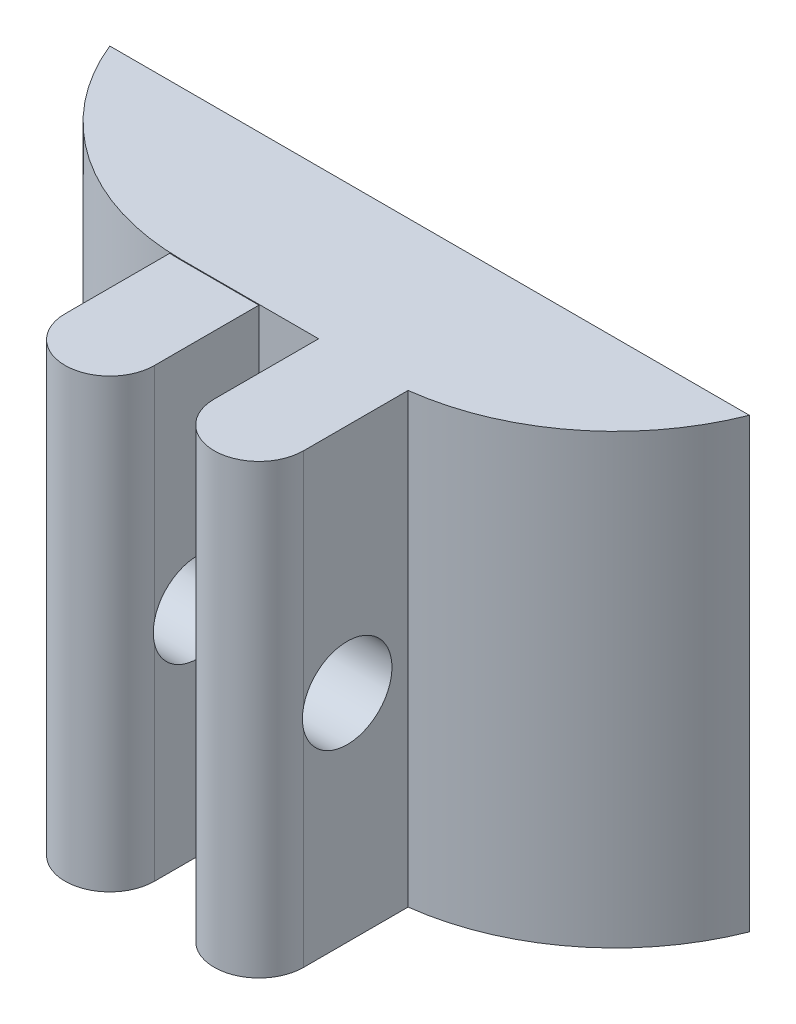
ISO-10303-21;
HEADER;
FILE_DESCRIPTION(('STEP AP214'),'2;1');
FILE_NAME('part.step','',(''),(''),'','','');
FILE_SCHEMA(('AUTOMOTIVE_DESIGN { 1 0 10303 214 1 1 1 1 }'));
ENDSEC;
DATA;
#1=APPLICATION_CONTEXT('core data for automotive mechanical design processes');
#2=APPLICATION_PROTOCOL_DEFINITION('international standard','automotive_design',2000,#1);
#3=PRODUCT_CONTEXT('',#1,'mechanical');
#4=PRODUCT('Part','Part','',(#3));
#5=PRODUCT_RELATED_PRODUCT_CATEGORY('part','',(#4));
#6=PRODUCT_DEFINITION_FORMATION('','',#4);
#7=PRODUCT_DEFINITION_CONTEXT('part definition',#1,'design');
#8=PRODUCT_DEFINITION('design','',#6,#7);
#9=PRODUCT_DEFINITION_SHAPE('','',#8);
#10=(LENGTH_UNIT() NAMED_UNIT(*) SI_UNIT(.MILLI.,.METRE.));
#11=(NAMED_UNIT(*) PLANE_ANGLE_UNIT() SI_UNIT($,.RADIAN.));
#12=(NAMED_UNIT(*) SI_UNIT($,.STERADIAN.) SOLID_ANGLE_UNIT());
#13=UNCERTAINTY_MEASURE_WITH_UNIT(LENGTH_MEASURE(1.E-05),#10,'distance_accuracy_value','');
#14=(GEOMETRIC_REPRESENTATION_CONTEXT(3) GLOBAL_UNCERTAINTY_ASSIGNED_CONTEXT((#13)) GLOBAL_UNIT_ASSIGNED_CONTEXT((#10,
#11,#12)) REPRESENTATION_CONTEXT('',''));
#15=CARTESIAN_POINT('',(0.,0.,0.));
#16=DIRECTION('',(0.,0.,1.));
#17=DIRECTION('',(1.,0.,0.));
#18=AXIS2_PLACEMENT_3D('',#15,#16,#17);
#19=CARTESIAN_POINT('',(-8.49999999999999,-15.,8.5));
#20=DIRECTION('',(0.,-1.,0.));
#21=DIRECTION('',(1.,0.,0.));
#22=AXIS2_PLACEMENT_3D('',#19,#20,#21);
#23=CYLINDRICAL_SURFACE('',#22,1.5);
#24=DIRECTION('',(0.,1.,0.));
#25=VECTOR('',#24,1.);
#26=CARTESIAN_POINT('',(-9.99999999999999,-15.,8.5));
#27=LINE('',#26,#25);
#28=CARTESIAN_POINT('',(-9.99999999999999,-15.,8.5));
#29=VERTEX_POINT('',#28);
#30=CARTESIAN_POINT('',(-10.,-8.11241498930769,8.5));
#31=VERTEX_POINT('',#30);
#32=EDGE_CURVE('E268',#29,#31,#27,.T.);
#33=ORIENTED_EDGE('',*,*,#32,.F.);
#34=CARTESIAN_POINT('',(-8.49999999999999,-15.,8.5));
#35=DIRECTION('',(0.,1.,0.));
#36=DIRECTION('',(-1.,0.,0.));
#37=AXIS2_PLACEMENT_3D('',#34,#35,#36);
#38=CIRCLE('',#37,1.5);
#39=CARTESIAN_POINT('',(-7.,-15.,8.5));
#40=VERTEX_POINT('',#39);
#41=EDGE_CURVE('E48',#40,#29,#38,.F.);
#42=ORIENTED_EDGE('',*,*,#41,.F.);
#43=DIRECTION('',(0.,1.,0.));
#44=VECTOR('',#43,1.);
#45=CARTESIAN_POINT('',(-7.,-15.,8.5));
#46=LINE('',#45,#44);
#47=CARTESIAN_POINT('',(-7.,-8.11241498930769,8.5));
#48=VERTEX_POINT('',#47);
#49=EDGE_CURVE('E275',#48,#40,#46,.F.);
#50=ORIENTED_EDGE('',*,*,#49,.F.);
#51=CARTESIAN_POINT('',(-7.,-7.41254560298488,8.5));
#52=CARTESIAN_POINT('',(-7.00001371546828,-7.45412724418204,8.50998083315785));
#53=CARTESIAN_POINT('',(-7.0001002060891,-7.49613741775952,8.51817415680516));
#54=CARTESIAN_POINT('',(-7.0003019560262,-7.58070019302562,8.53094623275822));
#55=CARTESIAN_POINT('',(-7.00041721297341,-7.6232527497722,8.53552528259058));
#56=CARTESIAN_POINT('',(-7.00055778771822,-7.70741499094998,8.54095494207867));
#57=CARTESIAN_POINT('',(-7.00058549988733,-7.74901828635982,8.54190496227109));
#58=CARTESIAN_POINT('',(-7.00054226277862,-7.83215876470274,8.54034650872186));
#59=CARTESIAN_POINT('',(-7.0004713169154,-7.8736959498741,8.53783815467585));
#60=CARTESIAN_POINT('',(-7.00028181879158,-7.95642005855864,8.52937975231243));
#61=CARTESIAN_POINT('',(-7.00016326453282,-7.99760696729637,8.52342955953406));
#62=CARTESIAN_POINT('',(-7.00000273049525,-8.07934507147401,8.50812900417141));
#63=CARTESIAN_POINT('',(-6.99996075234869,-8.11989625334496,8.49877856911518));
#64=CARTESIAN_POINT('',(-7.00014167531044,-8.20122206947848,8.47642670475488));
#65=CARTESIAN_POINT('',(-7.00037213747244,-8.24197030682407,8.46332907491474));
#66=CARTESIAN_POINT('',(-7.0013953460393,-8.322200778971,8.4337059956231));
#67=CARTESIAN_POINT('',(-7.00218818592812,-8.36168280214909,8.4171799765941));
#68=CARTESIAN_POINT('',(-7.00340465615959,-8.40037620756465,8.39899318441214));
#69=B_SPLINE_CURVE_WITH_KNOTS('',3,(#51,#52,#53,#54,#55,#56,#57,#58,#59,#60,#61,#62,#63,#64,#65,
#66,#67,#68),.UNSPECIFIED.,.F.,.F.,(4,2,2,2,2,2,2,2,4),(0.,0.128248812008016,0.256487065486652,
0.381186174696835,0.505880968132206,0.630580995641018,0.755283681131895,0.883530080847568,
1.01179780394237),.UNSPECIFIED.);
#70=CARTESIAN_POINT('',(-7.,-7.41254560298488,8.5));
#71=VERTEX_POINT('',#70);
#72=EDGE_CURVE('E260',#71,#48,#69,.T.);
#73=ORIENTED_EDGE('',*,*,#72,.F.);
#74=DIRECTION('',(0.,1.,0.));
#75=VECTOR('',#74,1.);
#76=CARTESIAN_POINT('',(-7.,-15.,8.5));
#77=LINE('',#76,#75);
#78=CARTESIAN_POINT('',(-7.,0.,8.5));
#79=VERTEX_POINT('',#78);
#80=EDGE_CURVE('E277',#79,#71,#77,.F.);
#81=ORIENTED_EDGE('',*,*,#80,.F.);
#82=CARTESIAN_POINT('',(-8.5,0.,8.5));
#83=DIRECTION('',(0.,-1.,0.));
#84=DIRECTION('',(1.,0.,0.));
#85=AXIS2_PLACEMENT_3D('',#82,#83,#84);
#86=CIRCLE('',#85,1.5);
#87=CARTESIAN_POINT('',(-10.,0.,8.5));
#88=VERTEX_POINT('',#87);
#89=EDGE_CURVE('E11',#88,#79,#86,.F.);
#90=ORIENTED_EDGE('',*,*,#89,.F.);
#91=DIRECTION('',(0.,1.,0.));
#92=VECTOR('',#91,1.);
#93=CARTESIAN_POINT('',(-9.99999999999999,-15.,8.5));
#94=LINE('',#93,#92);
#95=CARTESIAN_POINT('',(-10.,-7.41254560298488,8.5));
#96=VERTEX_POINT('',#95);
#97=EDGE_CURVE('E283',#96,#88,#94,.T.);
#98=ORIENTED_EDGE('',*,*,#97,.F.);
#99=CARTESIAN_POINT('',(-10.,-8.11241498930769,8.5));
#100=CARTESIAN_POINT('',(-9.99998628453172,-8.07083334811054,8.50998083315785));
#101=CARTESIAN_POINT('',(-9.99989979391089,-8.02882317453306,8.51817415680516));
#102=CARTESIAN_POINT('',(-9.99969804397379,-7.94426039926696,8.53094623275822));
#103=CARTESIAN_POINT('',(-9.99958278702658,-7.90170784252037,8.53552528259058));
#104=CARTESIAN_POINT('',(-9.99944221228177,-7.8175456013426,8.54095494207867));
#105=CARTESIAN_POINT('',(-9.99941450011267,-7.77594230593276,8.54190496227109));
#106=CARTESIAN_POINT('',(-9.99945773722137,-7.69280182758984,8.54034650872186));
#107=CARTESIAN_POINT('',(-9.99952868308459,-7.65126464241848,8.53783815467585));
#108=CARTESIAN_POINT('',(-9.99971818120842,-7.56854053373394,8.52937975231243));
#109=CARTESIAN_POINT('',(-9.99983673546718,-7.52735362499621,8.52342955953406));
#110=CARTESIAN_POINT('',(-9.99999726950474,-7.44561552081858,8.50812900417141));
#111=CARTESIAN_POINT('',(-10.0000392476513,-7.40506433894762,8.49877856911519));
#112=CARTESIAN_POINT('',(-9.99985832468955,-7.3237385228141,8.47642670475488));
#113=CARTESIAN_POINT('',(-9.99962786252755,-7.28299028546851,8.46332907491475));
#114=CARTESIAN_POINT('',(-9.9986046539607,-7.20275981332158,8.4337059956231));
#115=CARTESIAN_POINT('',(-9.99781181407187,-7.16327779014349,8.41717997659411));
#116=CARTESIAN_POINT('',(-9.99659534384041,-7.12458438472793,8.39899318441214));
#117=B_SPLINE_CURVE_WITH_KNOTS('',3,(#99,#100,#101,#102,#103,#104,#105,#106,#107,#108,#109,#110,
#111,#112,#113,#114,#115,#116),.UNSPECIFIED.,.F.,.F.,(4,2,2,2,2,2,2,2,4),(0.,0.128248812008016,
0.25648706548665,0.381186174696835,0.505880968132204,0.630580995641014,0.755283681131891,
0.883530080847564,1.01179780394237),.UNSPECIFIED.);
#118=EDGE_CURVE('E267',#31,#96,#117,.T.);
#119=ORIENTED_EDGE('',*,*,#118,.F.);
#120=EDGE_LOOP('',(#33,#42,#50,#73,#81,#90,#98,#119));
#121=FACE_BOUND('',#120,.T.);
#122=ADVANCED_FACE('F39',(#121),#23,.T.);
#123=CARTESIAN_POINT('',(-13.5,-15.,8.5));
#124=DIRECTION('',(0.,-1.,0.));
#125=DIRECTION('',(1.,0.,0.));
#126=AXIS2_PLACEMENT_3D('',#123,#124,#125);
#127=CYLINDRICAL_SURFACE('',#126,1.5);
#128=DIRECTION('',(0.,1.,0.));
#129=VECTOR('',#128,1.);
#130=CARTESIAN_POINT('',(-15.,-15.,8.5));
#131=LINE('',#130,#129);
#132=CARTESIAN_POINT('',(-15.,-15.,8.5));
#133=VERTEX_POINT('',#132);
#134=CARTESIAN_POINT('',(-15.,-8.11241498930769,8.5));
#135=VERTEX_POINT('',#134);
#136=EDGE_CURVE('E225',#133,#135,#131,.T.);
#137=ORIENTED_EDGE('',*,*,#136,.F.);
#138=CARTESIAN_POINT('',(-13.5,-15.,8.5));
#139=DIRECTION('',(0.,1.,0.));
#140=DIRECTION('',(-1.,0.,0.));
#141=AXIS2_PLACEMENT_3D('',#138,#139,#140);
#142=CIRCLE('',#141,1.5);
#143=CARTESIAN_POINT('',(-12.,-15.,8.5));
#144=VERTEX_POINT('',#143);
#145=EDGE_CURVE('E319',#144,#133,#142,.F.);
#146=ORIENTED_EDGE('',*,*,#145,.F.);
#147=DIRECTION('',(0.,1.,0.));
#148=VECTOR('',#147,1.);
#149=CARTESIAN_POINT('',(-12.,-15.,8.5));
#150=LINE('',#149,#148);
#151=CARTESIAN_POINT('',(-12.,-8.11241498930769,8.5));
#152=VERTEX_POINT('',#151);
#153=EDGE_CURVE('E152',#152,#144,#150,.F.);
#154=ORIENTED_EDGE('',*,*,#153,.F.);
#155=CARTESIAN_POINT('',(-12.,-7.41254560298488,8.5));
#156=CARTESIAN_POINT('',(-12.0000137154683,-7.45412724418204,8.50998083315785));
#157=CARTESIAN_POINT('',(-12.0001002060891,-7.49613741775952,8.51817415680516));
#158=CARTESIAN_POINT('',(-12.0003019560262,-7.58070019302562,8.53094623275822));
#159=CARTESIAN_POINT('',(-12.0004172129734,-7.6232527497722,8.53552528259058));
#160=CARTESIAN_POINT('',(-12.0005577877182,-7.70741499094998,8.54095494207867));
#161=CARTESIAN_POINT('',(-12.0005854998873,-7.74901828635982,8.54190496227109));
#162=CARTESIAN_POINT('',(-12.0005422627786,-7.83215876470274,8.54034650872186));
#163=CARTESIAN_POINT('',(-12.0004713169154,-7.8736959498741,8.53783815467585));
#164=CARTESIAN_POINT('',(-12.0002818187916,-7.95642005855864,8.52937975231243));
#165=CARTESIAN_POINT('',(-12.0001632645328,-7.99760696729637,8.52342955953406));
#166=CARTESIAN_POINT('',(-12.0000027304953,-8.07934507147401,8.50812900417141));
#167=CARTESIAN_POINT('',(-11.9999607523487,-8.11989625334496,8.49877856911518));
#168=CARTESIAN_POINT('',(-12.0001416753104,-8.20122206947848,8.47642670475488));
#169=CARTESIAN_POINT('',(-12.0003721374724,-8.24197030682407,8.46332907491474));
#170=CARTESIAN_POINT('',(-12.0013953460393,-8.322200778971,8.4337059956231));
#171=CARTESIAN_POINT('',(-12.0021881859281,-8.36168280214909,8.4171799765941));
#172=CARTESIAN_POINT('',(-12.0034046561596,-8.40037620756465,8.39899318441214));
#173=B_SPLINE_CURVE_WITH_KNOTS('',3,(#155,#156,#157,#158,#159,#160,#161,#162,#163,#164,#165,
#166,#167,#168,#169,#170,#171,#172),.UNSPECIFIED.,.F.,.F.,(4,2,2,2,2,2,2,2,4),(0.,
0.128248812008016,0.256487065486652,0.381186174696835,0.505880968132206,0.630580995641018,
0.755283681131895,0.883530080847568,1.01179780394237),.UNSPECIFIED.);
#174=CARTESIAN_POINT('',(-12.,-7.41254560298488,8.5));
#175=VERTEX_POINT('',#174);
#176=EDGE_CURVE('E228',#175,#152,#173,.T.);
#177=ORIENTED_EDGE('',*,*,#176,.F.);
#178=DIRECTION('',(0.,1.,0.));
#179=VECTOR('',#178,1.);
#180=CARTESIAN_POINT('',(-12.,-15.,8.5));
#181=LINE('',#180,#179);
#182=CARTESIAN_POINT('',(-12.,-0.0236385703849002,8.5));
#183=VERTEX_POINT('',#182);
#184=EDGE_CURVE('E318',#183,#175,#181,.F.);
#185=ORIENTED_EDGE('',*,*,#184,.F.);
#186=CARTESIAN_POINT('',(-13.5,-0.0236385703849002,8.5));
#187=DIRECTION('',(0.,-1.,0.));
#188=DIRECTION('',(0.,0.,-1.));
#189=AXIS2_PLACEMENT_3D('',#186,#187,#188);
#190=CIRCLE('',#189,1.5);
#191=CARTESIAN_POINT('',(-15.,-0.0236385703849002,8.5));
#192=VERTEX_POINT('',#191);
#193=EDGE_CURVE('E299',#192,#183,#190,.F.);
#194=ORIENTED_EDGE('',*,*,#193,.F.);
#195=DIRECTION('',(0.,1.,0.));
#196=VECTOR('',#195,1.);
#197=CARTESIAN_POINT('',(-15.,-15.,8.5));
#198=LINE('',#197,#196);
#199=CARTESIAN_POINT('',(-15.,-7.41254560298488,8.5));
#200=VERTEX_POINT('',#199);
#201=EDGE_CURVE('E222',#200,#192,#198,.T.);
#202=ORIENTED_EDGE('',*,*,#201,.F.);
#203=CARTESIAN_POINT('',(-15.,-8.11241498930769,8.5));
#204=CARTESIAN_POINT('',(-14.9999862845317,-8.07083334811054,8.50998083315785));
#205=CARTESIAN_POINT('',(-14.9998997939109,-8.02882317453306,8.51817415680516));
#206=CARTESIAN_POINT('',(-14.9996980439738,-7.94426039926696,8.53094623275822));
#207=CARTESIAN_POINT('',(-14.9995827870266,-7.90170784252037,8.53552528259058));
#208=CARTESIAN_POINT('',(-14.9994422122818,-7.8175456013426,8.54095494207867));
#209=CARTESIAN_POINT('',(-14.9994145001127,-7.77594230593276,8.54190496227109));
#210=CARTESIAN_POINT('',(-14.9994577372214,-7.69280182758984,8.54034650872186));
#211=CARTESIAN_POINT('',(-14.9995286830846,-7.65126464241848,8.53783815467585));
#212=CARTESIAN_POINT('',(-14.9997181812084,-7.56854053373394,8.52937975231243));
#213=CARTESIAN_POINT('',(-14.9998367354672,-7.52735362499621,8.52342955953406));
#214=CARTESIAN_POINT('',(-14.9999972695047,-7.44561552081857,8.50812900417141));
#215=CARTESIAN_POINT('',(-15.0000392476513,-7.40506433894762,8.49877856911519));
#216=CARTESIAN_POINT('',(-14.9998583246896,-7.3237385228141,8.47642670475488));
#217=CARTESIAN_POINT('',(-14.9996278625276,-7.28299028546851,8.46332907491475));
#218=CARTESIAN_POINT('',(-14.9986046539607,-7.20275981332158,8.4337059956231));
#219=CARTESIAN_POINT('',(-14.9978118140719,-7.16327779014349,8.41717997659411));
#220=CARTESIAN_POINT('',(-14.9965953438404,-7.12458438472793,8.39899318441214));
#221=B_SPLINE_CURVE_WITH_KNOTS('',3,(#203,#204,#205,#206,#207,#208,#209,#210,#211,#212,#213,
#214,#215,#216,#217,#218,#219,#220),.UNSPECIFIED.,.F.,.F.,(4,2,2,2,2,2,2,2,4),(0.,
0.128248812008016,0.256487065486652,0.381186174696835,0.505880968132205,0.630580995641015,
0.755283681131893,0.883530080847566,1.01179780394237),.UNSPECIFIED.);
#222=EDGE_CURVE('E236',#135,#200,#221,.T.);
#223=ORIENTED_EDGE('',*,*,#222,.F.);
#224=EDGE_LOOP('',(#137,#146,#154,#177,#185,#194,#202,#223));
#225=FACE_BOUND('',#224,.T.);
#226=ADVANCED_FACE('F243',(#225),#127,.T.);
#227=CARTESIAN_POINT('',(0.,0.,5.));
#228=DIRECTION('',(0.,0.,-1.));
#229=DIRECTION('',(-1.,0.,0.));
#230=AXIS2_PLACEMENT_3D('',#227,#228,#229);
#231=PLANE('',#230);
#232=DIRECTION('',(-1.,0.,0.));
#233=VECTOR('',#232,1.);
#234=CARTESIAN_POINT('',(0.,0.,5.));
#235=LINE('',#234,#233);
#236=CARTESIAN_POINT('',(-10.,0.,5.));
#237=VERTEX_POINT('',#236);
#238=CARTESIAN_POINT('',(-14.5838015129043,0.,5.));
#239=VERTEX_POINT('',#238);
#240=EDGE_CURVE('E167',#237,#239,#235,.T.);
#241=ORIENTED_EDGE('',*,*,#240,.T.);
#242=DIRECTION('',(0.,1.,0.));
#243=VECTOR('',#242,1.);
#244=CARTESIAN_POINT('',(-14.5838015129043,0.,5.));
#245=LINE('',#244,#243);
#246=CARTESIAN_POINT('',(-14.5838015129043,-0.0236385703849002,5.));
#247=VERTEX_POINT('',#246);
#248=EDGE_CURVE('E214',#239,#247,#245,.F.);
#249=ORIENTED_EDGE('',*,*,#248,.T.);
#250=DIRECTION('',(-1.,0.,0.));
#251=VECTOR('',#250,1.);
#252=CARTESIAN_POINT('',(-15.,-0.0236385703849002,5.));
#253=LINE('',#252,#251);
#254=CARTESIAN_POINT('',(-12.,-0.0236385703849002,5.));
#255=VERTEX_POINT('',#254);
#256=EDGE_CURVE('E174',#255,#247,#253,.T.);
#257=ORIENTED_EDGE('',*,*,#256,.F.);
#258=DIRECTION('',(0.,1.,0.));
#259=VECTOR('',#258,1.);
#260=CARTESIAN_POINT('',(-12.,-0.0236385703849002,5.));
#261=LINE('',#260,#259);
#262=CARTESIAN_POINT('',(-12.,-15.,5.));
#263=VERTEX_POINT('',#262);
#264=EDGE_CURVE('E150',#263,#255,#261,.T.);
#265=ORIENTED_EDGE('',*,*,#264,.F.);
#266=DIRECTION('',(1.,0.,0.));
#267=VECTOR('',#266,1.);
#268=CARTESIAN_POINT('',(0.,-15.,5.));
#269=LINE('',#268,#267);
#270=CARTESIAN_POINT('',(-10.,-15.,5.));
#271=VERTEX_POINT('',#270);
#272=EDGE_CURVE('E158',#263,#271,#269,.T.);
#273=ORIENTED_EDGE('',*,*,#272,.T.);
#274=DIRECTION('',(0.,-1.,0.));
#275=VECTOR('',#274,1.);
#276=CARTESIAN_POINT('',(-10.,0.,5.));
#277=LINE('',#276,#275);
#278=EDGE_CURVE('E175',#237,#271,#277,.T.);
#279=ORIENTED_EDGE('',*,*,#278,.F.);
#280=EDGE_LOOP('',(#241,#249,#257,#265,#273,#279));
#281=FACE_BOUND('',#280,.T.);
#282=ADVANCED_FACE('F171',(#281),#231,.F.);
#283=CARTESIAN_POINT('',(0.,0.,5.));
#284=DIRECTION('',(0.,-1.,0.));
#285=DIRECTION('',(1.,0.,0.));
#286=AXIS2_PLACEMENT_3D('',#283,#284,#285);
#287=PLANE('',#286);
#288=DIRECTION('',(0.,0.,-1.));
#289=VECTOR('',#288,1.);
#290=CARTESIAN_POINT('',(-10.,0.,10.));
#291=LINE('',#290,#289);
#292=EDGE_CURVE('E185',#88,#237,#291,.T.);
#293=ORIENTED_EDGE('',*,*,#292,.F.);
#294=ORIENTED_EDGE('',*,*,#89,.T.);
#295=DIRECTION('',(0.,0.,-1.));
#296=VECTOR('',#295,1.);
#297=CARTESIAN_POINT('',(-7.,0.,10.));
#298=LINE('',#297,#296);
#299=CARTESIAN_POINT('',(-7.,0.,5.));
#300=VERTEX_POINT('',#299);
#301=EDGE_CURVE('E187',#79,#300,#298,.T.);
#302=ORIENTED_EDGE('',*,*,#301,.T.);
#303=CARTESIAN_POINT('',(-8.,0.,-2.93725393319377));
#304=DIRECTION('',(0.,-1.,0.));
#305=DIRECTION('',(1.,0.,0.));
#306=AXIS2_PLACEMENT_3D('',#303,#304,#305);
#307=CIRCLE('',#306,8.);
#308=CARTESIAN_POINT('',(-0.558727304288753,0.,0.));
#309=VERTEX_POINT('',#308);
#310=EDGE_CURVE('E205',#300,#309,#307,.F.);
#311=ORIENTED_EDGE('',*,*,#310,.T.);
#312=DIRECTION('',(-1.,0.,0.));
#313=VECTOR('',#312,1.);
#314=CARTESIAN_POINT('',(0.,0.,0.));
#315=LINE('',#314,#313);
#316=CARTESIAN_POINT('',(-22.,0.,0.));
#317=VERTEX_POINT('',#316);
#318=EDGE_CURVE('E192',#309,#317,#315,.T.);
#319=ORIENTED_EDGE('',*,*,#318,.T.);
#320=CARTESIAN_POINT('',(-14.5838015129043,0.,-3.));
#321=DIRECTION('',(0.,-1.,0.));
#322=DIRECTION('',(1.,0.,0.));
#323=AXIS2_PLACEMENT_3D('',#320,#321,#322);
#324=CIRCLE('',#323,8.);
#325=EDGE_CURVE('E166',#317,#239,#324,.F.);
#326=ORIENTED_EDGE('',*,*,#325,.T.);
#327=ORIENTED_EDGE('',*,*,#240,.F.);
#328=EDGE_LOOP('',(#293,#294,#302,#311,#319,#326,#327));
#329=FACE_BOUND('',#328,.T.);
#330=ADVANCED_FACE('F288',(#329),#287,.F.);
#331=CARTESIAN_POINT('',(0.,-15.,5.));
#332=DIRECTION('',(0.,1.,0.));
#333=DIRECTION('',(-1.,0.,0.));
#334=AXIS2_PLACEMENT_3D('',#331,#332,#333);
#335=PLANE('',#334);
#336=DIRECTION('',(0.,0.,-1.));
#337=VECTOR('',#336,1.);
#338=CARTESIAN_POINT('',(-7.,-15.,10.));
#339=LINE('',#338,#337);
#340=CARTESIAN_POINT('',(-7.,-15.,5.));
#341=VERTEX_POINT('',#340);
#342=EDGE_CURVE('E189',#40,#341,#339,.T.);
#343=ORIENTED_EDGE('',*,*,#342,.F.);
#344=ORIENTED_EDGE('',*,*,#41,.T.);
#345=DIRECTION('',(0.,0.,-1.));
#346=VECTOR('',#345,1.);
#347=CARTESIAN_POINT('',(-9.99999999999999,-15.,10.));
#348=LINE('',#347,#346);
#349=EDGE_CURVE('E162',#29,#271,#348,.T.);
#350=ORIENTED_EDGE('',*,*,#349,.T.);
#351=ORIENTED_EDGE('',*,*,#272,.F.);
#352=DIRECTION('',(0.,0.,-1.));
#353=VECTOR('',#352,1.);
#354=CARTESIAN_POINT('',(-12.,-15.,10.));
#355=LINE('',#354,#353);
#356=EDGE_CURVE('E145',#144,#263,#355,.T.);
#357=ORIENTED_EDGE('',*,*,#356,.F.);
#358=ORIENTED_EDGE('',*,*,#145,.T.);
#359=DIRECTION('',(0.,0.,-1.));
#360=VECTOR('',#359,1.);
#361=CARTESIAN_POINT('',(-15.,-15.,10.));
#362=LINE('',#361,#360);
#363=CARTESIAN_POINT('',(-15.,-15.,4.98916634069784));
#364=VERTEX_POINT('',#363);
#365=EDGE_CURVE('E155',#133,#364,#362,.T.);
#366=ORIENTED_EDGE('',*,*,#365,.T.);
#367=CARTESIAN_POINT('',(-14.5838015129043,-15.,-3.));
#368=DIRECTION('',(0.,1.,0.));
#369=DIRECTION('',(-1.,0.,0.));
#370=AXIS2_PLACEMENT_3D('',#367,#368,#369);
#371=CIRCLE('',#370,8.);
#372=CARTESIAN_POINT('',(-22.,-15.,0.));
#373=VERTEX_POINT('',#372);
#374=EDGE_CURVE('E209',#364,#373,#371,.F.);
#375=ORIENTED_EDGE('',*,*,#374,.T.);
#376=DIRECTION('',(1.,0.,0.));
#377=VECTOR('',#376,1.);
#378=CARTESIAN_POINT('',(0.,-15.,0.));
#379=LINE('',#378,#377);
#380=CARTESIAN_POINT('',(-0.558727304288752,-15.,0.));
#381=VERTEX_POINT('',#380);
#382=EDGE_CURVE('E193',#373,#381,#379,.T.);
#383=ORIENTED_EDGE('',*,*,#382,.T.);
#384=CARTESIAN_POINT('',(-8.,-15.,-2.93725393319377));
#385=DIRECTION('',(0.,1.,0.));
#386=DIRECTION('',(-1.,0.,0.));
#387=AXIS2_PLACEMENT_3D('',#384,#385,#386);
#388=CIRCLE('',#387,8.);
#389=EDGE_CURVE('E211',#381,#341,#388,.F.);
#390=ORIENTED_EDGE('',*,*,#389,.T.);
#391=EDGE_LOOP('',(#343,#344,#350,#351,#357,#358,#366,#375,#383,#390));
#392=FACE_BOUND('',#391,.T.);
#393=ADVANCED_FACE('F160',(#392),#335,.F.);
#394=CARTESIAN_POINT('',(0.,0.,0.));
#395=DIRECTION('',(0.,0.,-1.));
#396=DIRECTION('',(-1.,0.,0.));
#397=AXIS2_PLACEMENT_3D('',#394,#395,#396);
#398=PLANE('',#397);
#399=ORIENTED_EDGE('',*,*,#318,.F.);
#400=DIRECTION('',(0.,1.,0.));
#401=VECTOR('',#400,1.);
#402=CARTESIAN_POINT('',(-0.558727304288753,-7.5,0.));
#403=LINE('',#402,#401);
#404=EDGE_CURVE('E207',#309,#381,#403,.F.);
#405=ORIENTED_EDGE('',*,*,#404,.T.);
#406=ORIENTED_EDGE('',*,*,#382,.F.);
#407=DIRECTION('',(0.,-1.,0.));
#408=VECTOR('',#407,1.);
#409=CARTESIAN_POINT('',(-22.,0.,0.));
#410=LINE('',#409,#408);
#411=EDGE_CURVE('E196',#317,#373,#410,.T.);
#412=ORIENTED_EDGE('',*,*,#411,.F.);
#413=EDGE_LOOP('',(#399,#405,#406,#412));
#414=FACE_BOUND('',#413,.T.);
#415=ADVANCED_FACE('F345',(#414),#398,.T.);
#416=CARTESIAN_POINT('',(-10.,0.,10.));
#417=DIRECTION('',(1.,0.,0.));
#418=DIRECTION('',(0.,1.,0.));
#419=AXIS2_PLACEMENT_3D('',#416,#417,#418);
#420=PLANE('',#419);
#421=ORIENTED_EDGE('',*,*,#349,.F.);
#422=ORIENTED_EDGE('',*,*,#32,.T.);
#423=CARTESIAN_POINT('',(-10.,-7.76248029614629,7.04138911613754));
#424=DIRECTION('',(1.,0.,0.));
#425=DIRECTION('',(0.,1.,0.));
#426=AXIS2_PLACEMENT_3D('',#423,#424,#425);
#427=CIRCLE('',#426,1.5);
#428=EDGE_CURVE('E304',#31,#96,#427,.T.);
#429=ORIENTED_EDGE('',*,*,#428,.T.);
#430=ORIENTED_EDGE('',*,*,#97,.T.);
#431=ORIENTED_EDGE('',*,*,#292,.T.);
#432=ORIENTED_EDGE('',*,*,#278,.T.);
#433=EDGE_LOOP('',(#421,#422,#429,#430,#431,#432));
#434=FACE_BOUND('',#433,.T.);
#435=ADVANCED_FACE('F284',(#434),#420,.F.);
#436=CARTESIAN_POINT('',(-7.,0.,10.));
#437=DIRECTION('',(-1.,0.,0.));
#438=DIRECTION('',(0.,-1.,0.));
#439=AXIS2_PLACEMENT_3D('',#436,#437,#438);
#440=PLANE('',#439);
#441=ORIENTED_EDGE('',*,*,#301,.F.);
#442=ORIENTED_EDGE('',*,*,#80,.T.);
#443=CARTESIAN_POINT('',(-7.,-7.76248029614629,7.04138911613754));
#444=DIRECTION('',(-1.,0.,0.));
#445=DIRECTION('',(0.,-1.,0.));
#446=AXIS2_PLACEMENT_3D('',#443,#444,#445);
#447=CIRCLE('',#446,1.5);
#448=EDGE_CURVE('E306',#71,#48,#447,.T.);
#449=ORIENTED_EDGE('',*,*,#448,.T.);
#450=ORIENTED_EDGE('',*,*,#49,.T.);
#451=ORIENTED_EDGE('',*,*,#342,.T.);
#452=DIRECTION('',(0.,1.,0.));
#453=VECTOR('',#452,1.);
#454=CARTESIAN_POINT('',(-7.,0.,5.));
#455=LINE('',#454,#453);
#456=EDGE_CURVE('E177',#341,#300,#455,.T.);
#457=ORIENTED_EDGE('',*,*,#456,.T.);
#458=EDGE_LOOP('',(#441,#442,#449,#450,#451,#457));
#459=FACE_BOUND('',#458,.T.);
#460=ADVANCED_FACE('F372',(#459),#440,.F.);
#461=CARTESIAN_POINT('',(-15.,-0.0236385703849002,10.));
#462=DIRECTION('',(1.,0.,0.));
#463=DIRECTION('',(0.,1.,0.));
#464=AXIS2_PLACEMENT_3D('',#461,#462,#463);
#465=PLANE('',#464);
#466=ORIENTED_EDGE('',*,*,#365,.F.);
#467=ORIENTED_EDGE('',*,*,#136,.T.);
#468=CARTESIAN_POINT('',(-15.,-7.76248029614629,7.04138911613754));
#469=DIRECTION('',(1.,0.,0.));
#470=DIRECTION('',(0.,1.,0.));
#471=AXIS2_PLACEMENT_3D('',#468,#469,#470);
#472=CIRCLE('',#471,1.5);
#473=EDGE_CURVE('E203',#135,#200,#472,.T.);
#474=ORIENTED_EDGE('',*,*,#473,.T.);
#475=ORIENTED_EDGE('',*,*,#201,.T.);
#476=DIRECTION('',(0.,0.,-1.));
#477=VECTOR('',#476,1.);
#478=CARTESIAN_POINT('',(-15.,-0.0236385703849002,10.));
#479=LINE('',#478,#477);
#480=CARTESIAN_POINT('',(-15.,-0.0236385703849002,4.98916634069784));
#481=VERTEX_POINT('',#480);
#482=EDGE_CURVE('E179',#192,#481,#479,.T.);
#483=ORIENTED_EDGE('',*,*,#482,.T.);
#484=DIRECTION('',(0.,1.,0.));
#485=VECTOR('',#484,1.);
#486=CARTESIAN_POINT('',(-15.,-0.0236385703849002,4.98916634069784));
#487=LINE('',#486,#485);
#488=EDGE_CURVE('E219',#481,#364,#487,.F.);
#489=ORIENTED_EDGE('',*,*,#488,.T.);
#490=EDGE_LOOP('',(#466,#467,#474,#475,#483,#489));
#491=FACE_BOUND('',#490,.T.);
#492=ADVANCED_FACE('F253',(#491),#465,.F.);
#493=CARTESIAN_POINT('',(-12.,-0.0236385703849002,10.));
#494=DIRECTION('',(-1.,0.,0.));
#495=DIRECTION('',(0.,-1.,0.));
#496=AXIS2_PLACEMENT_3D('',#493,#494,#495);
#497=PLANE('',#496);
#498=DIRECTION('',(0.,0.,-1.));
#499=VECTOR('',#498,1.);
#500=CARTESIAN_POINT('',(-12.,-0.0236385703849002,10.));
#501=LINE('',#500,#499);
#502=EDGE_CURVE('E154',#183,#255,#501,.T.);
#503=ORIENTED_EDGE('',*,*,#502,.F.);
#504=ORIENTED_EDGE('',*,*,#184,.T.);
#505=CARTESIAN_POINT('',(-12.,-7.76248029614629,7.04138911613754));
#506=DIRECTION('',(-1.,0.,0.));
#507=DIRECTION('',(0.,-1.,0.));
#508=AXIS2_PLACEMENT_3D('',#505,#506,#507);
#509=CIRCLE('',#508,1.5);
#510=EDGE_CURVE('E201',#175,#152,#509,.T.);
#511=ORIENTED_EDGE('',*,*,#510,.T.);
#512=ORIENTED_EDGE('',*,*,#153,.T.);
#513=ORIENTED_EDGE('',*,*,#356,.T.);
#514=ORIENTED_EDGE('',*,*,#264,.T.);
#515=EDGE_LOOP('',(#503,#504,#511,#512,#513,#514));
#516=FACE_BOUND('',#515,.T.);
#517=ADVANCED_FACE('F148',(#516),#497,.F.);
#518=CARTESIAN_POINT('',(-15.,-0.0236385703849002,10.));
#519=DIRECTION('',(0.,-1.,0.));
#520=DIRECTION('',(0.,0.,-1.));
#521=AXIS2_PLACEMENT_3D('',#518,#519,#520);
#522=PLANE('',#521);
#523=ORIENTED_EDGE('',*,*,#482,.F.);
#524=ORIENTED_EDGE('',*,*,#193,.T.);
#525=ORIENTED_EDGE('',*,*,#502,.T.);
#526=ORIENTED_EDGE('',*,*,#256,.T.);
#527=CARTESIAN_POINT('',(-14.5838015129043,-0.0236385703849002,-3.));
#528=DIRECTION('',(0.,-1.,0.));
#529=DIRECTION('',(0.,0.,-1.));
#530=AXIS2_PLACEMENT_3D('',#527,#528,#529);
#531=CIRCLE('',#530,8.);
#532=EDGE_CURVE('E216',#247,#481,#531,.T.);
#533=ORIENTED_EDGE('',*,*,#532,.T.);
#534=EDGE_LOOP('',(#523,#524,#525,#526,#533));
#535=FACE_BOUND('',#534,.T.);
#536=ADVANCED_FACE('F298',(#535),#522,.F.);
#537=CARTESIAN_POINT('',(-22.,-7.76248029614629,7.04138911613754));
#538=DIRECTION('',(1.,0.,0.));
#539=DIRECTION('',(0.,0.,-1.));
#540=AXIS2_PLACEMENT_3D('',#537,#538,#539);
#541=CYLINDRICAL_SURFACE('',#540,1.5);
#542=ORIENTED_EDGE('',*,*,#510,.F.);
#543=ORIENTED_EDGE('',*,*,#176,.T.);
#544=EDGE_LOOP('',(#542,#543));
#545=FACE_BOUND('',#544,.T.);
#546=ORIENTED_EDGE('',*,*,#473,.F.);
#547=ORIENTED_EDGE('',*,*,#222,.T.);
#548=EDGE_LOOP('',(#546,#547));
#549=FACE_BOUND('',#548,.T.);
#550=ADVANCED_FACE('F251',(#545,#549),#541,.F.);
#551=ORIENTED_EDGE('',*,*,#448,.F.);
#552=ORIENTED_EDGE('',*,*,#72,.T.);
#553=EDGE_LOOP('',(#551,#552));
#554=FACE_BOUND('',#553,.T.);
#555=ORIENTED_EDGE('',*,*,#428,.F.);
#556=ORIENTED_EDGE('',*,*,#118,.T.);
#557=EDGE_LOOP('',(#555,#556));
#558=FACE_BOUND('',#557,.T.);
#559=ADVANCED_FACE('F246',(#554,#558),#541,.F.);
#560=CARTESIAN_POINT('',(-8.,0.,-2.93725393319377));
#561=DIRECTION('',(0.,1.,0.));
#562=DIRECTION('',(-1.,0.,0.));
#563=AXIS2_PLACEMENT_3D('',#560,#561,#562);
#564=CYLINDRICAL_SURFACE('',#563,8.);
#565=ORIENTED_EDGE('',*,*,#389,.F.);
#566=ORIENTED_EDGE('',*,*,#404,.F.);
#567=ORIENTED_EDGE('',*,*,#310,.F.);
#568=ORIENTED_EDGE('',*,*,#456,.F.);
#569=EDGE_LOOP('',(#565,#566,#567,#568));
#570=FACE_BOUND('',#569,.T.);
#571=ADVANCED_FACE('F250',(#570),#564,.T.);
#572=CARTESIAN_POINT('',(-14.5838015129043,0.,-3.));
#573=DIRECTION('',(0.,1.,0.));
#574=DIRECTION('',(-1.,0.,0.));
#575=AXIS2_PLACEMENT_3D('',#572,#573,#574);
#576=CYLINDRICAL_SURFACE('',#575,8.);
#577=ORIENTED_EDGE('',*,*,#325,.F.);
#578=ORIENTED_EDGE('',*,*,#411,.T.);
#579=ORIENTED_EDGE('',*,*,#374,.F.);
#580=ORIENTED_EDGE('',*,*,#488,.F.);
#581=ORIENTED_EDGE('',*,*,#532,.F.);
#582=ORIENTED_EDGE('',*,*,#248,.F.);
#583=EDGE_LOOP('',(#577,#578,#579,#580,#581,#582));
#584=FACE_BOUND('',#583,.T.);
#585=ADVANCED_FACE('F293',(#584),#576,.T.);
#586=CLOSED_SHELL('',(#122,#226,#282,#330,#393,#415,#435,#460,#492,#517,#536,#550,#559,#571,#585));
#587=MANIFOLD_SOLID_BREP('B2',#586);
#588=ADVANCED_BREP_SHAPE_REPRESENTATION('',(#18,#587),#14);
#589=SHAPE_DEFINITION_REPRESENTATION(#9,#588);
ENDSEC;
END-ISO-10303-21;
